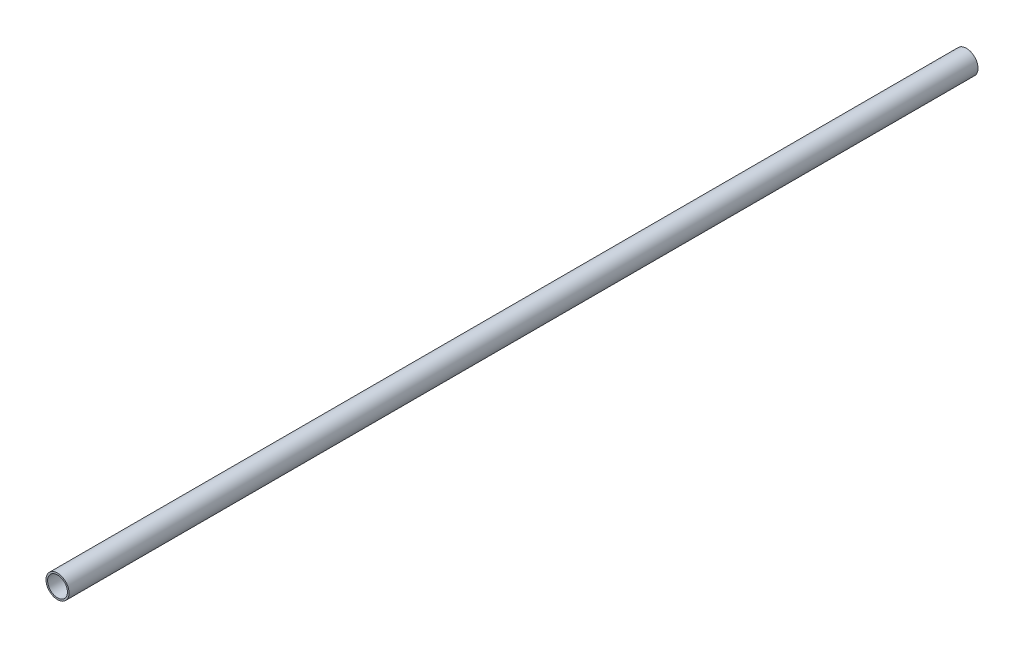
ISO-10303-21;
HEADER;
FILE_DESCRIPTION(('STEP AP214'),'2;1');
FILE_NAME('part.step','',(''),(''),'','','');
FILE_SCHEMA(('AUTOMOTIVE_DESIGN { 1 0 10303 214 1 1 1 1 }'));
ENDSEC;
DATA;
#1=APPLICATION_CONTEXT('core data for automotive mechanical design processes');
#2=APPLICATION_PROTOCOL_DEFINITION('international standard','automotive_design',2000,#1);
#3=PRODUCT_CONTEXT('',#1,'mechanical');
#4=PRODUCT('Part','Part','',(#3));
#5=PRODUCT_RELATED_PRODUCT_CATEGORY('part','',(#4));
#6=PRODUCT_DEFINITION_FORMATION('','',#4);
#7=PRODUCT_DEFINITION_CONTEXT('part definition',#1,'design');
#8=PRODUCT_DEFINITION('design','',#6,#7);
#9=PRODUCT_DEFINITION_SHAPE('','',#8);
#10=(LENGTH_UNIT() NAMED_UNIT(*) SI_UNIT(.MILLI.,.METRE.));
#11=(NAMED_UNIT(*) PLANE_ANGLE_UNIT() SI_UNIT($,.RADIAN.));
#12=(NAMED_UNIT(*) SI_UNIT($,.STERADIAN.) SOLID_ANGLE_UNIT());
#13=UNCERTAINTY_MEASURE_WITH_UNIT(LENGTH_MEASURE(1.E-05),#10,'distance_accuracy_value','');
#14=(GEOMETRIC_REPRESENTATION_CONTEXT(3) GLOBAL_UNCERTAINTY_ASSIGNED_CONTEXT((#13)) GLOBAL_UNIT_ASSIGNED_CONTEXT((#10,
#11,#12)) REPRESENTATION_CONTEXT('',''));
#15=CARTESIAN_POINT('',(0.,0.,0.));
#16=DIRECTION('',(0.,0.,1.));
#17=DIRECTION('',(1.,0.,0.));
#18=AXIS2_PLACEMENT_3D('',#15,#16,#17);
#19=CARTESIAN_POINT('',(0.,0.,500.));
#20=DIRECTION('',(0.,0.,1.));
#21=DIRECTION('',(1.,0.,0.));
#22=AXIS2_PLACEMENT_3D('',#19,#20,#21);
#23=PLANE('',#22);
#24=CARTESIAN_POINT('',(0.,0.,500.));
#25=DIRECTION('',(0.,0.,1.));
#26=DIRECTION('',(1.,0.,0.));
#27=AXIS2_PLACEMENT_3D('',#24,#25,#26);
#28=CIRCLE('',#27,6.35);
#29=CARTESIAN_POINT('',(6.35,0.,500.));
#30=VERTEX_POINT('',#29);
#31=EDGE_CURVE('E10',#30,#30,#28,.T.);
#32=ORIENTED_EDGE('',*,*,#31,.T.);
#33=EDGE_LOOP('',(#32));
#34=FACE_BOUND('',#33,.T.);
#35=CARTESIAN_POINT('',(0.,0.,500.));
#36=DIRECTION('',(0.,0.,1.));
#37=DIRECTION('',(1.,0.,0.));
#38=AXIS2_PLACEMENT_3D('',#35,#36,#37);
#39=CIRCLE('',#38,5.461);
#40=CARTESIAN_POINT('',(5.461,0.,500.));
#41=VERTEX_POINT('',#40);
#42=EDGE_CURVE('E50',#41,#41,#39,.T.);
#43=ORIENTED_EDGE('',*,*,#42,.F.);
#44=EDGE_LOOP('',(#43));
#45=FACE_BOUND('',#44,.T.);
#46=ADVANCED_FACE('F37',(#34,#45),#23,.T.);
#47=CARTESIAN_POINT('',(0.,0.,0.));
#48=DIRECTION('',(0.,0.,1.));
#49=DIRECTION('',(1.,0.,0.));
#50=AXIS2_PLACEMENT_3D('',#47,#48,#49);
#51=PLANE('',#50);
#52=CARTESIAN_POINT('',(0.,0.,0.));
#53=DIRECTION('',(0.,0.,1.));
#54=DIRECTION('',(1.,0.,0.));
#55=AXIS2_PLACEMENT_3D('',#52,#53,#54);
#56=CIRCLE('',#55,6.35);
#57=CARTESIAN_POINT('',(6.35,0.,0.));
#58=VERTEX_POINT('',#57);
#59=EDGE_CURVE('E41',#58,#58,#56,.T.);
#60=ORIENTED_EDGE('',*,*,#59,.F.);
#61=EDGE_LOOP('',(#60));
#62=FACE_BOUND('',#61,.T.);
#63=CARTESIAN_POINT('',(0.,0.,0.));
#64=DIRECTION('',(0.,0.,1.));
#65=DIRECTION('',(1.,0.,0.));
#66=AXIS2_PLACEMENT_3D('',#63,#64,#65);
#67=CIRCLE('',#66,5.461);
#68=CARTESIAN_POINT('',(5.461,0.,0.));
#69=VERTEX_POINT('',#68);
#70=EDGE_CURVE('E52',#69,#69,#67,.T.);
#71=ORIENTED_EDGE('',*,*,#70,.T.);
#72=EDGE_LOOP('',(#71));
#73=FACE_BOUND('',#72,.T.);
#74=ADVANCED_FACE('F64',(#62,#73),#51,.F.);
#75=CARTESIAN_POINT('',(0.,0.,500.));
#76=DIRECTION('',(0.,0.,-1.));
#77=DIRECTION('',(-1.,0.,0.));
#78=AXIS2_PLACEMENT_3D('',#75,#76,#77);
#79=CYLINDRICAL_SURFACE('',#78,6.35);
#80=ORIENTED_EDGE('',*,*,#31,.F.);
#81=EDGE_LOOP('',(#80));
#82=FACE_BOUND('',#81,.T.);
#83=ORIENTED_EDGE('',*,*,#59,.T.);
#84=EDGE_LOOP('',(#83));
#85=FACE_BOUND('',#84,.T.);
#86=ADVANCED_FACE('F39',(#82,#85),#79,.T.);
#87=CARTESIAN_POINT('',(0.,0.,500.));
#88=DIRECTION('',(0.,0.,-1.));
#89=DIRECTION('',(-1.,0.,0.));
#90=AXIS2_PLACEMENT_3D('',#87,#88,#89);
#91=CYLINDRICAL_SURFACE('',#90,5.461);
#92=ORIENTED_EDGE('',*,*,#42,.T.);
#93=EDGE_LOOP('',(#92));
#94=FACE_BOUND('',#93,.T.);
#95=ORIENTED_EDGE('',*,*,#70,.F.);
#96=EDGE_LOOP('',(#95));
#97=FACE_BOUND('',#96,.T.);
#98=ADVANCED_FACE('F60',(#94,#97),#91,.F.);
#99=CLOSED_SHELL('',(#46,#74,#86,#98));
#100=MANIFOLD_SOLID_BREP('B2',#99);
#101=ADVANCED_BREP_SHAPE_REPRESENTATION('',(#18,#100),#14);
#102=SHAPE_DEFINITION_REPRESENTATION(#9,#101);
ENDSEC;
END-ISO-10303-21;
